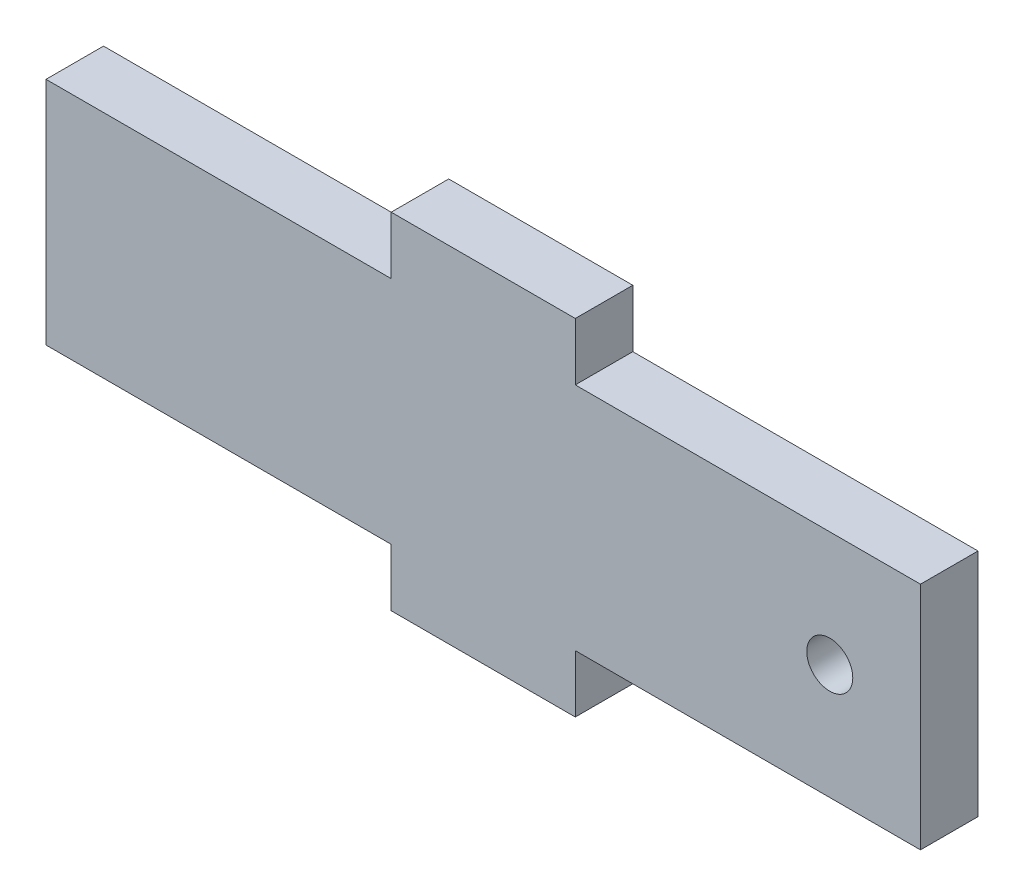
ISO-10303-21;
HEADER;
FILE_DESCRIPTION(('STEP AP214'),'2;1');
FILE_NAME('part.step','',(''),(''),'','','');
FILE_SCHEMA(('AUTOMOTIVE_DESIGN { 1 0 10303 214 1 1 1 1 }'));
ENDSEC;
DATA;
#1=APPLICATION_CONTEXT('core data for automotive mechanical design processes');
#2=APPLICATION_PROTOCOL_DEFINITION('international standard','automotive_design',2000,#1);
#3=PRODUCT_CONTEXT('',#1,'mechanical');
#4=PRODUCT('Part','Part','',(#3));
#5=PRODUCT_RELATED_PRODUCT_CATEGORY('part','',(#4));
#6=PRODUCT_DEFINITION_FORMATION('','',#4);
#7=PRODUCT_DEFINITION_CONTEXT('part definition',#1,'design');
#8=PRODUCT_DEFINITION('design','',#6,#7);
#9=PRODUCT_DEFINITION_SHAPE('','',#8);
#10=(LENGTH_UNIT() NAMED_UNIT(*) SI_UNIT(.MILLI.,.METRE.));
#11=(NAMED_UNIT(*) PLANE_ANGLE_UNIT() SI_UNIT($,.RADIAN.));
#12=(NAMED_UNIT(*) SI_UNIT($,.STERADIAN.) SOLID_ANGLE_UNIT());
#13=UNCERTAINTY_MEASURE_WITH_UNIT(LENGTH_MEASURE(1.E-05),#10,'distance_accuracy_value','');
#14=(GEOMETRIC_REPRESENTATION_CONTEXT(3) GLOBAL_UNCERTAINTY_ASSIGNED_CONTEXT((#13)) GLOBAL_UNIT_ASSIGNED_CONTEXT((#10,
#11,#12)) REPRESENTATION_CONTEXT('',''));
#15=CARTESIAN_POINT('',(0.,0.,0.));
#16=DIRECTION('',(0.,0.,1.));
#17=DIRECTION('',(1.,0.,0.));
#18=AXIS2_PLACEMENT_3D('',#15,#16,#17);
#19=CARTESIAN_POINT('',(0.,0.,5.));
#20=DIRECTION('',(0.,0.,-1.));
#21=DIRECTION('',(-1.,0.,0.));
#22=AXIS2_PLACEMENT_3D('',#19,#20,#21);
#23=PLANE('',#22);
#24=DIRECTION('',(1.,0.,0.));
#25=VECTOR('',#24,1.);
#26=CARTESIAN_POINT('',(8.00000000000001,-10.,5.));
#27=LINE('',#26,#25);
#28=CARTESIAN_POINT('',(8.00000000000001,-10.,5.));
#29=VERTEX_POINT('',#28);
#30=CARTESIAN_POINT('',(38.,-10.,5.));
#31=VERTEX_POINT('',#30);
#32=EDGE_CURVE('E202',#29,#31,#27,.T.);
#33=ORIENTED_EDGE('',*,*,#32,.T.);
#34=DIRECTION('',(0.,1.,0.));
#35=VECTOR('',#34,1.);
#36=CARTESIAN_POINT('',(38.,10.,5.));
#37=LINE('',#36,#35);
#38=CARTESIAN_POINT('',(38.,10.,5.));
#39=VERTEX_POINT('',#38);
#40=EDGE_CURVE('E114',#31,#39,#37,.T.);
#41=ORIENTED_EDGE('',*,*,#40,.T.);
#42=DIRECTION('',(-1.,0.,0.));
#43=VECTOR('',#42,1.);
#44=CARTESIAN_POINT('',(8.00000000000001,10.,5.));
#45=LINE('',#44,#43);
#46=CARTESIAN_POINT('',(8.00000000000001,10.,5.));
#47=VERTEX_POINT('',#46);
#48=EDGE_CURVE('E239',#39,#47,#45,.T.);
#49=ORIENTED_EDGE('',*,*,#48,.T.);
#50=DIRECTION('',(0.,1.,0.));
#51=VECTOR('',#50,1.);
#52=CARTESIAN_POINT('',(8.,15.,5.));
#53=LINE('',#52,#51);
#54=CARTESIAN_POINT('',(8.,15.,5.));
#55=VERTEX_POINT('',#54);
#56=EDGE_CURVE('E259',#47,#55,#53,.T.);
#57=ORIENTED_EDGE('',*,*,#56,.T.);
#58=DIRECTION('',(-1.,0.,0.));
#59=VECTOR('',#58,1.);
#60=CARTESIAN_POINT('',(-8.,15.,5.));
#61=LINE('',#60,#59);
#62=CARTESIAN_POINT('',(-8.,15.,5.));
#63=VERTEX_POINT('',#62);
#64=EDGE_CURVE('E255',#55,#63,#61,.T.);
#65=ORIENTED_EDGE('',*,*,#64,.T.);
#66=DIRECTION('',(0.,-1.,0.));
#67=VECTOR('',#66,1.);
#68=CARTESIAN_POINT('',(-8.,10.,5.));
#69=LINE('',#68,#67);
#70=CARTESIAN_POINT('',(-8.,10.,5.));
#71=VERTEX_POINT('',#70);
#72=EDGE_CURVE('E258',#63,#71,#69,.T.);
#73=ORIENTED_EDGE('',*,*,#72,.T.);
#74=DIRECTION('',(-1.,0.,0.));
#75=VECTOR('',#74,1.);
#76=CARTESIAN_POINT('',(-38.,10.,5.));
#77=LINE('',#76,#75);
#78=CARTESIAN_POINT('',(-38.,10.,5.));
#79=VERTEX_POINT('',#78);
#80=EDGE_CURVE('E263',#71,#79,#77,.T.);
#81=ORIENTED_EDGE('',*,*,#80,.T.);
#82=DIRECTION('',(0.,-1.,0.));
#83=VECTOR('',#82,1.);
#84=CARTESIAN_POINT('',(-38.,10.,5.));
#85=LINE('',#84,#83);
#86=CARTESIAN_POINT('',(-38.,-10.,5.));
#87=VERTEX_POINT('',#86);
#88=EDGE_CURVE('E270',#79,#87,#85,.T.);
#89=ORIENTED_EDGE('',*,*,#88,.T.);
#90=DIRECTION('',(1.,0.,0.));
#91=VECTOR('',#90,1.);
#92=CARTESIAN_POINT('',(-38.,-10.,5.));
#93=LINE('',#92,#91);
#94=CARTESIAN_POINT('',(-8.,-10.,5.));
#95=VERTEX_POINT('',#94);
#96=EDGE_CURVE('E145',#87,#95,#93,.T.);
#97=ORIENTED_EDGE('',*,*,#96,.T.);
#98=DIRECTION('',(0.,-1.,0.));
#99=VECTOR('',#98,1.);
#100=CARTESIAN_POINT('',(-8.,-10.,5.));
#101=LINE('',#100,#99);
#102=CARTESIAN_POINT('',(-8.,-15.,5.));
#103=VERTEX_POINT('',#102);
#104=EDGE_CURVE('E139',#95,#103,#101,.T.);
#105=ORIENTED_EDGE('',*,*,#104,.T.);
#106=DIRECTION('',(1.,0.,0.));
#107=VECTOR('',#106,1.);
#108=CARTESIAN_POINT('',(-8.,-15.,5.));
#109=LINE('',#108,#107);
#110=CARTESIAN_POINT('',(8.00000000000001,-15.,5.));
#111=VERTEX_POINT('',#110);
#112=EDGE_CURVE('E143',#103,#111,#109,.T.);
#113=ORIENTED_EDGE('',*,*,#112,.T.);
#114=DIRECTION('',(0.,1.,0.));
#115=VECTOR('',#114,1.);
#116=CARTESIAN_POINT('',(8.00000000000001,-15.,5.));
#117=LINE('',#116,#115);
#118=EDGE_CURVE('E59',#111,#29,#117,.T.);
#119=ORIENTED_EDGE('',*,*,#118,.T.);
#120=EDGE_LOOP('',(#33,#41,#49,#57,#65,#73,#81,#89,#97,#105,#113,#119));
#121=FACE_BOUND('',#120,.T.);
#122=CARTESIAN_POINT('',(30.1177174630473,0.,5.));
#123=DIRECTION('',(0.,0.,1.));
#124=DIRECTION('',(1.,0.,0.));
#125=AXIS2_PLACEMENT_3D('',#122,#123,#124);
#126=CIRCLE('',#125,2.);
#127=CARTESIAN_POINT('',(32.1177174630473,0.,5.));
#128=VERTEX_POINT('',#127);
#129=EDGE_CURVE('E172',#128,#128,#126,.T.);
#130=ORIENTED_EDGE('',*,*,#129,.F.);
#131=EDGE_LOOP('',(#130));
#132=FACE_BOUND('',#131,.T.);
#133=ADVANCED_FACE('F41',(#121,#132),#23,.F.);
#134=CARTESIAN_POINT('',(0.,0.,0.));
#135=DIRECTION('',(0.,0.,-1.));
#136=DIRECTION('',(-1.,0.,0.));
#137=AXIS2_PLACEMENT_3D('',#134,#135,#136);
#138=PLANE('',#137);
#139=DIRECTION('',(1.,0.,0.));
#140=VECTOR('',#139,1.);
#141=CARTESIAN_POINT('',(8.00000000000001,-10.,0.));
#142=LINE('',#141,#140);
#143=CARTESIAN_POINT('',(8.00000000000001,-10.,0.));
#144=VERTEX_POINT('',#143);
#145=CARTESIAN_POINT('',(38.,-10.,0.));
#146=VERTEX_POINT('',#145);
#147=EDGE_CURVE('E167',#144,#146,#142,.T.);
#148=ORIENTED_EDGE('',*,*,#147,.F.);
#149=DIRECTION('',(0.,1.,0.));
#150=VECTOR('',#149,1.);
#151=CARTESIAN_POINT('',(8.00000000000001,-15.,0.));
#152=LINE('',#151,#150);
#153=CARTESIAN_POINT('',(8.00000000000001,-15.,0.));
#154=VERTEX_POINT('',#153);
#155=EDGE_CURVE('E106',#154,#144,#152,.T.);
#156=ORIENTED_EDGE('',*,*,#155,.F.);
#157=DIRECTION('',(1.,0.,0.));
#158=VECTOR('',#157,1.);
#159=CARTESIAN_POINT('',(-8.,-15.,0.));
#160=LINE('',#159,#158);
#161=CARTESIAN_POINT('',(-8.,-15.,0.));
#162=VERTEX_POINT('',#161);
#163=EDGE_CURVE('E100',#162,#154,#160,.T.);
#164=ORIENTED_EDGE('',*,*,#163,.F.);
#165=DIRECTION('',(0.,-1.,0.));
#166=VECTOR('',#165,1.);
#167=CARTESIAN_POINT('',(-8.,-10.,0.));
#168=LINE('',#167,#166);
#169=CARTESIAN_POINT('',(-8.,-10.,0.));
#170=VERTEX_POINT('',#169);
#171=EDGE_CURVE('E154',#170,#162,#168,.T.);
#172=ORIENTED_EDGE('',*,*,#171,.F.);
#173=DIRECTION('',(1.,0.,0.));
#174=VECTOR('',#173,1.);
#175=CARTESIAN_POINT('',(-38.,-10.,0.));
#176=LINE('',#175,#174);
#177=CARTESIAN_POINT('',(-38.,-10.,0.));
#178=VERTEX_POINT('',#177);
#179=EDGE_CURVE('E193',#178,#170,#176,.T.);
#180=ORIENTED_EDGE('',*,*,#179,.F.);
#181=DIRECTION('',(0.,-1.,0.));
#182=VECTOR('',#181,1.);
#183=CARTESIAN_POINT('',(-38.,10.,0.));
#184=LINE('',#183,#182);
#185=CARTESIAN_POINT('',(-38.,10.,0.));
#186=VERTEX_POINT('',#185);
#187=EDGE_CURVE('E190',#186,#178,#184,.T.);
#188=ORIENTED_EDGE('',*,*,#187,.F.);
#189=DIRECTION('',(-1.,0.,0.));
#190=VECTOR('',#189,1.);
#191=CARTESIAN_POINT('',(-38.,10.,0.));
#192=LINE('',#191,#190);
#193=CARTESIAN_POINT('',(-8.,10.,0.));
#194=VERTEX_POINT('',#193);
#195=EDGE_CURVE('E187',#194,#186,#192,.T.);
#196=ORIENTED_EDGE('',*,*,#195,.F.);
#197=DIRECTION('',(0.,-1.,0.));
#198=VECTOR('',#197,1.);
#199=CARTESIAN_POINT('',(-8.,10.,0.));
#200=LINE('',#199,#198);
#201=CARTESIAN_POINT('',(-8.,15.,0.));
#202=VERTEX_POINT('',#201);
#203=EDGE_CURVE('E184',#202,#194,#200,.T.);
#204=ORIENTED_EDGE('',*,*,#203,.F.);
#205=DIRECTION('',(-1.,0.,0.));
#206=VECTOR('',#205,1.);
#207=CARTESIAN_POINT('',(-8.,15.,0.));
#208=LINE('',#207,#206);
#209=CARTESIAN_POINT('',(8.,15.,0.));
#210=VERTEX_POINT('',#209);
#211=EDGE_CURVE('E181',#210,#202,#208,.T.);
#212=ORIENTED_EDGE('',*,*,#211,.F.);
#213=DIRECTION('',(0.,1.,0.));
#214=VECTOR('',#213,1.);
#215=CARTESIAN_POINT('',(8.,15.,0.));
#216=LINE('',#215,#214);
#217=CARTESIAN_POINT('',(8.00000000000001,10.,0.));
#218=VERTEX_POINT('',#217);
#219=EDGE_CURVE('E178',#218,#210,#216,.T.);
#220=ORIENTED_EDGE('',*,*,#219,.F.);
#221=DIRECTION('',(-1.,0.,0.));
#222=VECTOR('',#221,1.);
#223=CARTESIAN_POINT('',(8.00000000000001,10.,0.));
#224=LINE('',#223,#222);
#225=CARTESIAN_POINT('',(38.,10.,0.));
#226=VERTEX_POINT('',#225);
#227=EDGE_CURVE('E175',#226,#218,#224,.T.);
#228=ORIENTED_EDGE('',*,*,#227,.F.);
#229=DIRECTION('',(0.,1.,0.));
#230=VECTOR('',#229,1.);
#231=CARTESIAN_POINT('',(38.,10.,0.));
#232=LINE('',#231,#230);
#233=EDGE_CURVE('E171',#146,#226,#232,.T.);
#234=ORIENTED_EDGE('',*,*,#233,.F.);
#235=EDGE_LOOP('',(#148,#156,#164,#172,#180,#188,#196,#204,#212,#220,#228,#234));
#236=FACE_BOUND('',#235,.T.);
#237=CARTESIAN_POINT('',(30.1177174630473,0.,0.));
#238=DIRECTION('',(0.,0.,1.));
#239=DIRECTION('',(1.,0.,0.));
#240=AXIS2_PLACEMENT_3D('',#237,#238,#239);
#241=CIRCLE('',#240,2.);
#242=CARTESIAN_POINT('',(32.1177174630473,0.,0.));
#243=VERTEX_POINT('',#242);
#244=EDGE_CURVE('E419',#243,#243,#241,.T.);
#245=ORIENTED_EDGE('',*,*,#244,.T.);
#246=EDGE_LOOP('',(#245));
#247=FACE_BOUND('',#246,.T.);
#248=ADVANCED_FACE('F243',(#236,#247),#138,.T.);
#249=CARTESIAN_POINT('',(8.00000000000001,-10.,5.));
#250=DIRECTION('',(0.,1.,0.));
#251=DIRECTION('',(0.,0.,1.));
#252=AXIS2_PLACEMENT_3D('',#249,#250,#251);
#253=PLANE('',#252);
#254=ORIENTED_EDGE('',*,*,#147,.T.);
#255=DIRECTION('',(0.,0.,-1.));
#256=VECTOR('',#255,1.);
#257=CARTESIAN_POINT('',(38.,-10.,5.));
#258=LINE('',#257,#256);
#259=EDGE_CURVE('E11',#31,#146,#258,.T.);
#260=ORIENTED_EDGE('',*,*,#259,.F.);
#261=ORIENTED_EDGE('',*,*,#32,.F.);
#262=DIRECTION('',(0.,0.,-1.));
#263=VECTOR('',#262,1.);
#264=CARTESIAN_POINT('',(8.00000000000001,-10.,5.));
#265=LINE('',#264,#263);
#266=EDGE_CURVE('E163',#29,#144,#265,.T.);
#267=ORIENTED_EDGE('',*,*,#266,.T.);
#268=EDGE_LOOP('',(#254,#260,#261,#267));
#269=FACE_BOUND('',#268,.T.);
#270=ADVANCED_FACE('F43',(#269),#253,.F.);
#271=CARTESIAN_POINT('',(38.,10.,5.));
#272=DIRECTION('',(-1.,0.,0.));
#273=DIRECTION('',(0.,-1.,0.));
#274=AXIS2_PLACEMENT_3D('',#271,#272,#273);
#275=PLANE('',#274);
#276=ORIENTED_EDGE('',*,*,#233,.T.);
#277=DIRECTION('',(0.,0.,-1.));
#278=VECTOR('',#277,1.);
#279=CARTESIAN_POINT('',(38.,10.,5.));
#280=LINE('',#279,#278);
#281=EDGE_CURVE('E51',#39,#226,#280,.T.);
#282=ORIENTED_EDGE('',*,*,#281,.F.);
#283=ORIENTED_EDGE('',*,*,#40,.F.);
#284=ORIENTED_EDGE('',*,*,#259,.T.);
#285=EDGE_LOOP('',(#276,#282,#283,#284));
#286=FACE_BOUND('',#285,.T.);
#287=ADVANCED_FACE('F306',(#286),#275,.F.);
#288=CARTESIAN_POINT('',(8.00000000000001,10.,5.));
#289=DIRECTION('',(0.,-1.,0.));
#290=DIRECTION('',(1.,0.,0.));
#291=AXIS2_PLACEMENT_3D('',#288,#289,#290);
#292=PLANE('',#291);
#293=ORIENTED_EDGE('',*,*,#227,.T.);
#294=DIRECTION('',(0.,0.,-1.));
#295=VECTOR('',#294,1.);
#296=CARTESIAN_POINT('',(8.00000000000001,10.,5.));
#297=LINE('',#296,#295);
#298=EDGE_CURVE('E229',#47,#218,#297,.T.);
#299=ORIENTED_EDGE('',*,*,#298,.F.);
#300=ORIENTED_EDGE('',*,*,#48,.F.);
#301=ORIENTED_EDGE('',*,*,#281,.T.);
#302=EDGE_LOOP('',(#293,#299,#300,#301));
#303=FACE_BOUND('',#302,.T.);
#304=ADVANCED_FACE('F237',(#303),#292,.F.);
#305=CARTESIAN_POINT('',(8.,15.,5.));
#306=DIRECTION('',(-1.,0.,0.));
#307=DIRECTION('',(0.,-1.,0.));
#308=AXIS2_PLACEMENT_3D('',#305,#306,#307);
#309=PLANE('',#308);
#310=ORIENTED_EDGE('',*,*,#219,.T.);
#311=DIRECTION('',(0.,0.,-1.));
#312=VECTOR('',#311,1.);
#313=CARTESIAN_POINT('',(8.,15.,5.));
#314=LINE('',#313,#312);
#315=EDGE_CURVE('E225',#55,#210,#314,.T.);
#316=ORIENTED_EDGE('',*,*,#315,.F.);
#317=ORIENTED_EDGE('',*,*,#56,.F.);
#318=ORIENTED_EDGE('',*,*,#298,.T.);
#319=EDGE_LOOP('',(#310,#316,#317,#318));
#320=FACE_BOUND('',#319,.T.);
#321=ADVANCED_FACE('F249',(#320),#309,.F.);
#322=CARTESIAN_POINT('',(-8.,15.,5.));
#323=DIRECTION('',(0.,-1.,0.));
#324=DIRECTION('',(1.,0.,0.));
#325=AXIS2_PLACEMENT_3D('',#322,#323,#324);
#326=PLANE('',#325);
#327=ORIENTED_EDGE('',*,*,#211,.T.);
#328=DIRECTION('',(0.,0.,-1.));
#329=VECTOR('',#328,1.);
#330=CARTESIAN_POINT('',(-8.,15.,5.));
#331=LINE('',#330,#329);
#332=EDGE_CURVE('E221',#63,#202,#331,.T.);
#333=ORIENTED_EDGE('',*,*,#332,.F.);
#334=ORIENTED_EDGE('',*,*,#64,.F.);
#335=ORIENTED_EDGE('',*,*,#315,.T.);
#336=EDGE_LOOP('',(#327,#333,#334,#335));
#337=FACE_BOUND('',#336,.T.);
#338=ADVANCED_FACE('F253',(#337),#326,.F.);
#339=CARTESIAN_POINT('',(-8.,10.,5.));
#340=DIRECTION('',(1.,0.,0.));
#341=DIRECTION('',(0.,0.,-1.));
#342=AXIS2_PLACEMENT_3D('',#339,#340,#341);
#343=PLANE('',#342);
#344=ORIENTED_EDGE('',*,*,#203,.T.);
#345=DIRECTION('',(0.,0.,-1.));
#346=VECTOR('',#345,1.);
#347=CARTESIAN_POINT('',(-8.,10.,5.));
#348=LINE('',#347,#346);
#349=EDGE_CURVE('E217',#71,#194,#348,.T.);
#350=ORIENTED_EDGE('',*,*,#349,.F.);
#351=ORIENTED_EDGE('',*,*,#72,.F.);
#352=ORIENTED_EDGE('',*,*,#332,.T.);
#353=EDGE_LOOP('',(#344,#350,#351,#352));
#354=FACE_BOUND('',#353,.T.);
#355=ADVANCED_FACE('F319',(#354),#343,.F.);
#356=CARTESIAN_POINT('',(-38.,10.,5.));
#357=DIRECTION('',(0.,-1.,0.));
#358=DIRECTION('',(0.,0.,-1.));
#359=AXIS2_PLACEMENT_3D('',#356,#357,#358);
#360=PLANE('',#359);
#361=ORIENTED_EDGE('',*,*,#195,.T.);
#362=DIRECTION('',(0.,0.,-1.));
#363=VECTOR('',#362,1.);
#364=CARTESIAN_POINT('',(-38.,10.,5.));
#365=LINE('',#364,#363);
#366=EDGE_CURVE('E213',#79,#186,#365,.T.);
#367=ORIENTED_EDGE('',*,*,#366,.F.);
#368=ORIENTED_EDGE('',*,*,#80,.F.);
#369=ORIENTED_EDGE('',*,*,#349,.T.);
#370=EDGE_LOOP('',(#361,#367,#368,#369));
#371=FACE_BOUND('',#370,.T.);
#372=ADVANCED_FACE('F322',(#371),#360,.F.);
#373=CARTESIAN_POINT('',(-38.,10.,5.));
#374=DIRECTION('',(1.,0.,0.));
#375=DIRECTION('',(0.,1.,0.));
#376=AXIS2_PLACEMENT_3D('',#373,#374,#375);
#377=PLANE('',#376);
#378=ORIENTED_EDGE('',*,*,#187,.T.);
#379=DIRECTION('',(0.,0.,-1.));
#380=VECTOR('',#379,1.);
#381=CARTESIAN_POINT('',(-38.,-10.,5.));
#382=LINE('',#381,#380);
#383=EDGE_CURVE('E209',#87,#178,#382,.T.);
#384=ORIENTED_EDGE('',*,*,#383,.F.);
#385=ORIENTED_EDGE('',*,*,#88,.F.);
#386=ORIENTED_EDGE('',*,*,#366,.T.);
#387=EDGE_LOOP('',(#378,#384,#385,#386));
#388=FACE_BOUND('',#387,.T.);
#389=ADVANCED_FACE('F278',(#388),#377,.F.);
#390=CARTESIAN_POINT('',(-38.,-10.,5.));
#391=DIRECTION('',(0.,1.,0.));
#392=DIRECTION('',(0.,0.,1.));
#393=AXIS2_PLACEMENT_3D('',#390,#391,#392);
#394=PLANE('',#393);
#395=ORIENTED_EDGE('',*,*,#179,.T.);
#396=DIRECTION('',(0.,0.,-1.));
#397=VECTOR('',#396,1.);
#398=CARTESIAN_POINT('',(-8.,-10.,5.));
#399=LINE('',#398,#397);
#400=EDGE_CURVE('E156',#95,#170,#399,.T.);
#401=ORIENTED_EDGE('',*,*,#400,.F.);
#402=ORIENTED_EDGE('',*,*,#96,.F.);
#403=ORIENTED_EDGE('',*,*,#383,.T.);
#404=EDGE_LOOP('',(#395,#401,#402,#403));
#405=FACE_BOUND('',#404,.T.);
#406=ADVANCED_FACE('F282',(#405),#394,.F.);
#407=CARTESIAN_POINT('',(-8.,-10.,5.));
#408=DIRECTION('',(1.,0.,0.));
#409=DIRECTION('',(0.,1.,0.));
#410=AXIS2_PLACEMENT_3D('',#407,#408,#409);
#411=PLANE('',#410);
#412=ORIENTED_EDGE('',*,*,#171,.T.);
#413=DIRECTION('',(0.,0.,-1.));
#414=VECTOR('',#413,1.);
#415=CARTESIAN_POINT('',(-8.,-15.,5.));
#416=LINE('',#415,#414);
#417=EDGE_CURVE('E151',#103,#162,#416,.T.);
#418=ORIENTED_EDGE('',*,*,#417,.F.);
#419=ORIENTED_EDGE('',*,*,#104,.F.);
#420=ORIENTED_EDGE('',*,*,#400,.T.);
#421=EDGE_LOOP('',(#412,#418,#419,#420));
#422=FACE_BOUND('',#421,.T.);
#423=ADVANCED_FACE('F152',(#422),#411,.F.);
#424=CARTESIAN_POINT('',(-8.,-15.,5.));
#425=DIRECTION('',(0.,1.,0.));
#426=DIRECTION('',(0.,0.,1.));
#427=AXIS2_PLACEMENT_3D('',#424,#425,#426);
#428=PLANE('',#427);
#429=ORIENTED_EDGE('',*,*,#163,.T.);
#430=DIRECTION('',(0.,0.,-1.));
#431=VECTOR('',#430,1.);
#432=CARTESIAN_POINT('',(8.00000000000001,-15.,5.));
#433=LINE('',#432,#431);
#434=EDGE_CURVE('E157',#111,#154,#433,.T.);
#435=ORIENTED_EDGE('',*,*,#434,.F.);
#436=ORIENTED_EDGE('',*,*,#112,.F.);
#437=ORIENTED_EDGE('',*,*,#417,.T.);
#438=EDGE_LOOP('',(#429,#435,#436,#437));
#439=FACE_BOUND('',#438,.T.);
#440=ADVANCED_FACE('F159',(#439),#428,.F.);
#441=CARTESIAN_POINT('',(8.00000000000001,-15.,5.));
#442=DIRECTION('',(-1.,0.,0.));
#443=DIRECTION('',(0.,-1.,0.));
#444=AXIS2_PLACEMENT_3D('',#441,#442,#443);
#445=PLANE('',#444);
#446=ORIENTED_EDGE('',*,*,#155,.T.);
#447=ORIENTED_EDGE('',*,*,#266,.F.);
#448=ORIENTED_EDGE('',*,*,#118,.F.);
#449=ORIENTED_EDGE('',*,*,#434,.T.);
#450=EDGE_LOOP('',(#446,#447,#448,#449));
#451=FACE_BOUND('',#450,.T.);
#452=ADVANCED_FACE('F286',(#451),#445,.F.);
#453=CARTESIAN_POINT('',(30.1177174630473,0.,5.));
#454=DIRECTION('',(0.,0.,-1.));
#455=DIRECTION('',(-1.,0.,0.));
#456=AXIS2_PLACEMENT_3D('',#453,#454,#455);
#457=CYLINDRICAL_SURFACE('',#456,2.);
#458=ORIENTED_EDGE('',*,*,#129,.T.);
#459=EDGE_LOOP('',(#458));
#460=FACE_BOUND('',#459,.T.);
#461=ORIENTED_EDGE('',*,*,#244,.F.);
#462=EDGE_LOOP('',(#461));
#463=FACE_BOUND('',#462,.T.);
#464=ADVANCED_FACE('F288',(#460,#463),#457,.F.);
#465=CLOSED_SHELL('',(#133,#248,#270,#287,#304,#321,#338,#355,#372,#389,#406,#423,#440,#452,#464));
#466=MANIFOLD_SOLID_BREP('B2',#465);
#467=ADVANCED_BREP_SHAPE_REPRESENTATION('',(#18,#466),#14);
#468=SHAPE_DEFINITION_REPRESENTATION(#9,#467);
ENDSEC;
END-ISO-10303-21;
